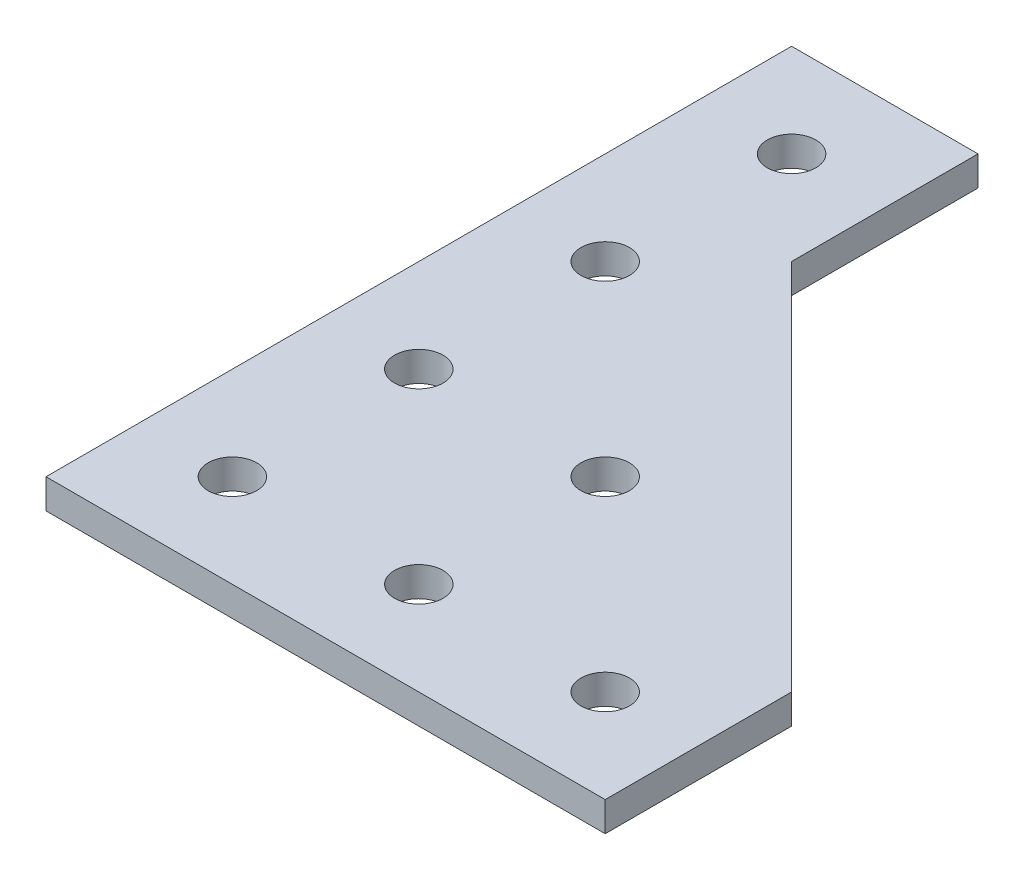
ISO-10303-21;
HEADER;
FILE_DESCRIPTION(('STEP AP214'),'2;1');
FILE_NAME('part.step','',(''),(''),'','','');
FILE_SCHEMA(('AUTOMOTIVE_DESIGN { 1 0 10303 214 1 1 1 1 }'));
ENDSEC;
DATA;
#1=APPLICATION_CONTEXT('core data for automotive mechanical design processes');
#2=APPLICATION_PROTOCOL_DEFINITION('international standard','automotive_design',2000,#1);
#3=PRODUCT_CONTEXT('',#1,'mechanical');
#4=PRODUCT('Part','Part','',(#3));
#5=PRODUCT_RELATED_PRODUCT_CATEGORY('part','',(#4));
#6=PRODUCT_DEFINITION_FORMATION('','',#4);
#7=PRODUCT_DEFINITION_CONTEXT('part definition',#1,'design');
#8=PRODUCT_DEFINITION('design','',#6,#7);
#9=PRODUCT_DEFINITION_SHAPE('','',#8);
#10=(LENGTH_UNIT() NAMED_UNIT(*) SI_UNIT(.MILLI.,.METRE.));
#11=(NAMED_UNIT(*) PLANE_ANGLE_UNIT() SI_UNIT($,.RADIAN.));
#12=(NAMED_UNIT(*) SI_UNIT($,.STERADIAN.) SOLID_ANGLE_UNIT());
#13=UNCERTAINTY_MEASURE_WITH_UNIT(LENGTH_MEASURE(1.E-05),#10,'distance_accuracy_value','');
#14=(GEOMETRIC_REPRESENTATION_CONTEXT(3) GLOBAL_UNCERTAINTY_ASSIGNED_CONTEXT((#13)) GLOBAL_UNIT_ASSIGNED_CONTEXT((#10,
#11,#12)) REPRESENTATION_CONTEXT('',''));
#15=CARTESIAN_POINT('',(0.,0.,0.));
#16=DIRECTION('',(0.,0.,1.));
#17=DIRECTION('',(1.,0.,0.));
#18=AXIS2_PLACEMENT_3D('',#15,#16,#17);
#19=CARTESIAN_POINT('',(0.,3.175,0.));
#20=DIRECTION('',(0.,1.,0.));
#21=DIRECTION('',(0.,0.,1.));
#22=AXIS2_PLACEMENT_3D('',#19,#20,#21);
#23=PLANE('',#22);
#24=CARTESIAN_POINT('',(9.99999999999962,3.175,-50.0000000000001));
#25=DIRECTION('',(0.,1.,0.));
#26=DIRECTION('',(0.,0.,1.));
#27=AXIS2_PLACEMENT_3D('',#24,#25,#26);
#28=CIRCLE('',#27,2.59999999999998);
#29=CARTESIAN_POINT('',(9.99999999999962,3.175,-47.4000000000001));
#30=VERTEX_POINT('',#29);
#31=EDGE_CURVE('E201',#30,#30,#28,.T.);
#32=ORIENTED_EDGE('',*,*,#31,.F.);
#33=EDGE_LOOP('',(#32));
#34=FACE_BOUND('',#33,.T.);
#35=CARTESIAN_POINT('',(9.99999999999976,3.175,-10.0000000000001));
#36=DIRECTION('',(0.,1.,0.));
#37=DIRECTION('',(0.,0.,1.));
#38=AXIS2_PLACEMENT_3D('',#35,#36,#37);
#39=CIRCLE('',#38,2.59999999999998);
#40=CARTESIAN_POINT('',(9.99999999999976,3.175,-7.40000000000011));
#41=VERTEX_POINT('',#40);
#42=EDGE_CURVE('E213',#41,#41,#39,.T.);
#43=ORIENTED_EDGE('',*,*,#42,.F.);
#44=EDGE_LOOP('',(#43));
#45=FACE_BOUND('',#44,.T.);
#46=CARTESIAN_POINT('',(49.9999999999998,3.175,-10.0000000000001));
#47=DIRECTION('',(0.,1.,0.));
#48=DIRECTION('',(0.,0.,1.));
#49=AXIS2_PLACEMENT_3D('',#46,#47,#48);
#50=CIRCLE('',#49,2.59999999999998);
#51=CARTESIAN_POINT('',(49.9999999999998,3.175,-7.40000000000011));
#52=VERTEX_POINT('',#51);
#53=EDGE_CURVE('E225',#52,#52,#50,.T.);
#54=ORIENTED_EDGE('',*,*,#53,.F.);
#55=EDGE_LOOP('',(#54));
#56=FACE_BOUND('',#55,.T.);
#57=DIRECTION('',(0.,0.,-1.));
#58=VECTOR('',#57,1.);
#59=CARTESIAN_POINT('',(59.9999999999995,3.175,-19.9999999999995));
#60=LINE('',#59,#58);
#61=CARTESIAN_POINT('',(60.,3.175,-1.57859836313889E-13));
#62=VERTEX_POINT('',#61);
#63=CARTESIAN_POINT('',(59.9999999999995,3.175,-19.9999999999995));
#64=VERTEX_POINT('',#63);
#65=EDGE_CURVE('E128',#62,#64,#60,.T.);
#66=ORIENTED_EDGE('',*,*,#65,.T.);
#67=DIRECTION('',(-0.707106781186539,0.,-0.707106781186556));
#68=VECTOR('',#67,1.);
#69=CARTESIAN_POINT('',(59.9999999999995,3.175,-19.9999999999995));
#70=LINE('',#69,#68);
#71=CARTESIAN_POINT('',(20.0000000000004,3.175,-59.9999999999996));
#72=VERTEX_POINT('',#71);
#73=EDGE_CURVE('E86',#64,#72,#70,.T.);
#74=ORIENTED_EDGE('',*,*,#73,.T.);
#75=DIRECTION('',(0.,0.,-1.));
#76=VECTOR('',#75,1.);
#77=CARTESIAN_POINT('',(20.0000000000002,3.175,-79.9999999999996));
#78=LINE('',#77,#76);
#79=CARTESIAN_POINT('',(20.0000000000002,3.175,-79.9999999999996));
#80=VERTEX_POINT('',#79);
#81=EDGE_CURVE('E99',#72,#80,#78,.T.);
#82=ORIENTED_EDGE('',*,*,#81,.T.);
#83=DIRECTION('',(-1.,0.,0.));
#84=VECTOR('',#83,1.);
#85=CARTESIAN_POINT('',(-1.91686944095437E-13,3.175,-79.9999999999996));
#86=LINE('',#85,#84);
#87=CARTESIAN_POINT('',(-1.91686944095437E-13,3.175,-79.9999999999996));
#88=VERTEX_POINT('',#87);
#89=EDGE_CURVE('E93',#80,#88,#86,.T.);
#90=ORIENTED_EDGE('',*,*,#89,.T.);
#91=DIRECTION('',(0.,0.,1.));
#92=VECTOR('',#91,1.);
#93=CARTESIAN_POINT('',(0.,3.175,0.));
#94=LINE('',#93,#92);
#95=CARTESIAN_POINT('',(0.,3.175,0.));
#96=VERTEX_POINT('',#95);
#97=EDGE_CURVE('E97',#88,#96,#94,.T.);
#98=ORIENTED_EDGE('',*,*,#97,.T.);
#99=DIRECTION('',(1.,0.,0.));
#100=VECTOR('',#99,1.);
#101=CARTESIAN_POINT('',(0.,3.175,0.));
#102=LINE('',#101,#100);
#103=EDGE_CURVE('E49',#96,#62,#102,.T.);
#104=ORIENTED_EDGE('',*,*,#103,.T.);
#105=EDGE_LOOP('',(#66,#74,#82,#90,#98,#104));
#106=FACE_BOUND('',#105,.T.);
#107=CARTESIAN_POINT('',(29.9999999999998,3.175,-10.0000000000001));
#108=DIRECTION('',(0.,1.,0.));
#109=DIRECTION('',(0.,0.,1.));
#110=AXIS2_PLACEMENT_3D('',#107,#108,#109);
#111=CIRCLE('',#110,2.59999999999998);
#112=CARTESIAN_POINT('',(29.9999999999998,3.175,-7.40000000000011));
#113=VERTEX_POINT('',#112);
#114=EDGE_CURVE('E121',#113,#113,#111,.T.);
#115=ORIENTED_EDGE('',*,*,#114,.F.);
#116=EDGE_LOOP('',(#115));
#117=FACE_BOUND('',#116,.T.);
#118=CARTESIAN_POINT('',(29.9999999999997,3.175,-30.0000000000001));
#119=DIRECTION('',(0.,1.,0.));
#120=DIRECTION('',(0.,0.,1.));
#121=AXIS2_PLACEMENT_3D('',#118,#119,#120);
#122=CIRCLE('',#121,2.59999999999998);
#123=CARTESIAN_POINT('',(29.9999999999997,3.175,-27.4000000000001));
#124=VERTEX_POINT('',#123);
#125=EDGE_CURVE('E219',#124,#124,#122,.T.);
#126=ORIENTED_EDGE('',*,*,#125,.F.);
#127=EDGE_LOOP('',(#126));
#128=FACE_BOUND('',#127,.T.);
#129=CARTESIAN_POINT('',(9.99999999999969,3.175,-30.0000000000001));
#130=DIRECTION('',(0.,1.,0.));
#131=DIRECTION('',(0.,0.,1.));
#132=AXIS2_PLACEMENT_3D('',#129,#130,#131);
#133=CIRCLE('',#132,2.59999999999998);
#134=CARTESIAN_POINT('',(9.99999999999969,3.175,-27.4000000000001));
#135=VERTEX_POINT('',#134);
#136=EDGE_CURVE('E207',#135,#135,#133,.T.);
#137=ORIENTED_EDGE('',*,*,#136,.F.);
#138=EDGE_LOOP('',(#137));
#139=FACE_BOUND('',#138,.T.);
#140=CARTESIAN_POINT('',(9.99999999999955,3.175,-70.0000000000001));
#141=DIRECTION('',(0.,1.,0.));
#142=DIRECTION('',(0.,0.,1.));
#143=AXIS2_PLACEMENT_3D('',#140,#141,#142);
#144=CIRCLE('',#143,2.59999999999998);
#145=CARTESIAN_POINT('',(9.99999999999955,3.175,-67.4000000000001));
#146=VERTEX_POINT('',#145);
#147=EDGE_CURVE('E192',#146,#146,#144,.T.);
#148=ORIENTED_EDGE('',*,*,#147,.F.);
#149=EDGE_LOOP('',(#148));
#150=FACE_BOUND('',#149,.T.);
#151=ADVANCED_FACE('F32',(#34,#45,#56,#106,#117,#128,#139,#150),#23,.T.);
#152=CARTESIAN_POINT('',(0.,0.,0.));
#153=DIRECTION('',(0.,1.,0.));
#154=DIRECTION('',(0.,0.,1.));
#155=AXIS2_PLACEMENT_3D('',#152,#153,#154);
#156=PLANE('',#155);
#157=CARTESIAN_POINT('',(9.99999999999962,0.,-50.0000000000001));
#158=DIRECTION('',(0.,1.,0.));
#159=DIRECTION('',(0.,0.,1.));
#160=AXIS2_PLACEMENT_3D('',#157,#158,#159);
#161=CIRCLE('',#160,2.59999999999998);
#162=CARTESIAN_POINT('',(9.99999999999962,0.,-47.4000000000001));
#163=VERTEX_POINT('',#162);
#164=EDGE_CURVE('E198',#163,#163,#161,.T.);
#165=ORIENTED_EDGE('',*,*,#164,.T.);
#166=EDGE_LOOP('',(#165));
#167=FACE_BOUND('',#166,.T.);
#168=CARTESIAN_POINT('',(9.99999999999976,0.,-10.0000000000001));
#169=DIRECTION('',(0.,1.,0.));
#170=DIRECTION('',(0.,0.,1.));
#171=AXIS2_PLACEMENT_3D('',#168,#169,#170);
#172=CIRCLE('',#171,2.59999999999998);
#173=CARTESIAN_POINT('',(9.99999999999976,0.,-7.40000000000011));
#174=VERTEX_POINT('',#173);
#175=EDGE_CURVE('E210',#174,#174,#172,.T.);
#176=ORIENTED_EDGE('',*,*,#175,.T.);
#177=EDGE_LOOP('',(#176));
#178=FACE_BOUND('',#177,.T.);
#179=CARTESIAN_POINT('',(49.9999999999998,0.,-10.0000000000001));
#180=DIRECTION('',(0.,1.,0.));
#181=DIRECTION('',(0.,0.,1.));
#182=AXIS2_PLACEMENT_3D('',#179,#180,#181);
#183=CIRCLE('',#182,2.59999999999998);
#184=CARTESIAN_POINT('',(49.9999999999998,0.,-7.40000000000011));
#185=VERTEX_POINT('',#184);
#186=EDGE_CURVE('E222',#185,#185,#183,.T.);
#187=ORIENTED_EDGE('',*,*,#186,.T.);
#188=EDGE_LOOP('',(#187));
#189=FACE_BOUND('',#188,.T.);
#190=DIRECTION('',(0.,0.,-1.));
#191=VECTOR('',#190,1.);
#192=CARTESIAN_POINT('',(59.9999999999995,0.,-19.9999999999995));
#193=LINE('',#192,#191);
#194=CARTESIAN_POINT('',(60.,0.,-1.57859836313889E-13));
#195=VERTEX_POINT('',#194);
#196=CARTESIAN_POINT('',(59.9999999999995,0.,-19.9999999999995));
#197=VERTEX_POINT('',#196);
#198=EDGE_CURVE('E117',#195,#197,#193,.T.);
#199=ORIENTED_EDGE('',*,*,#198,.F.);
#200=DIRECTION('',(1.,0.,0.));
#201=VECTOR('',#200,1.);
#202=CARTESIAN_POINT('',(0.,0.,0.));
#203=LINE('',#202,#201);
#204=CARTESIAN_POINT('',(0.,0.,0.));
#205=VERTEX_POINT('',#204);
#206=EDGE_CURVE('E78',#205,#195,#203,.T.);
#207=ORIENTED_EDGE('',*,*,#206,.F.);
#208=DIRECTION('',(0.,0.,1.));
#209=VECTOR('',#208,1.);
#210=CARTESIAN_POINT('',(0.,0.,0.));
#211=LINE('',#210,#209);
#212=CARTESIAN_POINT('',(-1.91686944095437E-13,0.,-79.9999999999996));
#213=VERTEX_POINT('',#212);
#214=EDGE_CURVE('E72',#213,#205,#211,.T.);
#215=ORIENTED_EDGE('',*,*,#214,.F.);
#216=DIRECTION('',(-1.,0.,0.));
#217=VECTOR('',#216,1.);
#218=CARTESIAN_POINT('',(-1.91686944095437E-13,0.,-79.9999999999996));
#219=LINE('',#218,#217);
#220=CARTESIAN_POINT('',(20.0000000000002,0.,-79.9999999999996));
#221=VERTEX_POINT('',#220);
#222=EDGE_CURVE('E107',#221,#213,#219,.T.);
#223=ORIENTED_EDGE('',*,*,#222,.F.);
#224=DIRECTION('',(0.,0.,-1.));
#225=VECTOR('',#224,1.);
#226=CARTESIAN_POINT('',(20.0000000000002,0.,-79.9999999999996));
#227=LINE('',#226,#225);
#228=CARTESIAN_POINT('',(20.0000000000004,0.,-59.9999999999996));
#229=VERTEX_POINT('',#228);
#230=EDGE_CURVE('E123',#229,#221,#227,.T.);
#231=ORIENTED_EDGE('',*,*,#230,.F.);
#232=DIRECTION('',(-0.707106781186539,0.,-0.707106781186556));
#233=VECTOR('',#232,1.);
#234=CARTESIAN_POINT('',(59.9999999999995,0.,-19.9999999999995));
#235=LINE('',#234,#233);
#236=EDGE_CURVE('E120',#197,#229,#235,.T.);
#237=ORIENTED_EDGE('',*,*,#236,.F.);
#238=EDGE_LOOP('',(#199,#207,#215,#223,#231,#237));
#239=FACE_BOUND('',#238,.T.);
#240=CARTESIAN_POINT('',(29.9999999999998,0.,-10.0000000000001));
#241=DIRECTION('',(0.,1.,0.));
#242=DIRECTION('',(0.,0.,1.));
#243=AXIS2_PLACEMENT_3D('',#240,#241,#242);
#244=CIRCLE('',#243,2.59999999999998);
#245=CARTESIAN_POINT('',(29.9999999999998,0.,-7.40000000000011));
#246=VERTEX_POINT('',#245);
#247=EDGE_CURVE('E228',#246,#246,#244,.T.);
#248=ORIENTED_EDGE('',*,*,#247,.T.);
#249=EDGE_LOOP('',(#248));
#250=FACE_BOUND('',#249,.T.);
#251=CARTESIAN_POINT('',(29.9999999999997,0.,-30.0000000000001));
#252=DIRECTION('',(0.,1.,0.));
#253=DIRECTION('',(0.,0.,1.));
#254=AXIS2_PLACEMENT_3D('',#251,#252,#253);
#255=CIRCLE('',#254,2.59999999999998);
#256=CARTESIAN_POINT('',(29.9999999999997,0.,-27.4000000000001));
#257=VERTEX_POINT('',#256);
#258=EDGE_CURVE('E216',#257,#257,#255,.T.);
#259=ORIENTED_EDGE('',*,*,#258,.T.);
#260=EDGE_LOOP('',(#259));
#261=FACE_BOUND('',#260,.T.);
#262=CARTESIAN_POINT('',(9.99999999999969,0.,-30.0000000000001));
#263=DIRECTION('',(0.,1.,0.));
#264=DIRECTION('',(0.,0.,1.));
#265=AXIS2_PLACEMENT_3D('',#262,#263,#264);
#266=CIRCLE('',#265,2.59999999999998);
#267=CARTESIAN_POINT('',(9.99999999999969,0.,-27.4000000000001));
#268=VERTEX_POINT('',#267);
#269=EDGE_CURVE('E204',#268,#268,#266,.T.);
#270=ORIENTED_EDGE('',*,*,#269,.T.);
#271=EDGE_LOOP('',(#270));
#272=FACE_BOUND('',#271,.T.);
#273=CARTESIAN_POINT('',(9.99999999999955,0.,-70.0000000000001));
#274=DIRECTION('',(0.,1.,0.));
#275=DIRECTION('',(0.,0.,1.));
#276=AXIS2_PLACEMENT_3D('',#273,#274,#275);
#277=CIRCLE('',#276,2.59999999999998);
#278=CARTESIAN_POINT('',(9.99999999999955,0.,-67.4000000000001));
#279=VERTEX_POINT('',#278);
#280=EDGE_CURVE('E195',#279,#279,#277,.T.);
#281=ORIENTED_EDGE('',*,*,#280,.T.);
#282=EDGE_LOOP('',(#281));
#283=FACE_BOUND('',#282,.T.);
#284=ADVANCED_FACE('F137',(#167,#178,#189,#239,#250,#261,#272,#283),#156,.F.);
#285=CARTESIAN_POINT('',(59.9999999999995,3.175,-19.9999999999995));
#286=DIRECTION('',(-1.,0.,0.));
#287=DIRECTION('',(0.,0.,1.));
#288=AXIS2_PLACEMENT_3D('',#285,#286,#287);
#289=PLANE('',#288);
#290=ORIENTED_EDGE('',*,*,#198,.T.);
#291=DIRECTION('',(0.,-1.,0.));
#292=VECTOR('',#291,1.);
#293=CARTESIAN_POINT('',(59.9999999999995,3.175,-19.9999999999995));
#294=LINE('',#293,#292);
#295=EDGE_CURVE('E11',#64,#197,#294,.T.);
#296=ORIENTED_EDGE('',*,*,#295,.F.);
#297=ORIENTED_EDGE('',*,*,#65,.F.);
#298=DIRECTION('',(0.,-1.,0.));
#299=VECTOR('',#298,1.);
#300=CARTESIAN_POINT('',(60.,3.175,-1.57859836313889E-13));
#301=LINE('',#300,#299);
#302=EDGE_CURVE('E113',#62,#195,#301,.T.);
#303=ORIENTED_EDGE('',*,*,#302,.T.);
#304=EDGE_LOOP('',(#290,#296,#297,#303));
#305=FACE_BOUND('',#304,.T.);
#306=ADVANCED_FACE('F34',(#305),#289,.F.);
#307=CARTESIAN_POINT('',(59.9999999999995,3.175,-19.9999999999995));
#308=DIRECTION('',(-0.707106781186556,0.,0.707106781186539));
#309=DIRECTION('',(0.707106781186539,0.,0.707106781186556));
#310=AXIS2_PLACEMENT_3D('',#307,#308,#309);
#311=PLANE('',#310);
#312=ORIENTED_EDGE('',*,*,#236,.T.);
#313=DIRECTION('',(0.,-1.,0.));
#314=VECTOR('',#313,1.);
#315=CARTESIAN_POINT('',(20.0000000000004,3.175,-59.9999999999996));
#316=LINE('',#315,#314);
#317=EDGE_CURVE('E41',#72,#229,#316,.T.);
#318=ORIENTED_EDGE('',*,*,#317,.F.);
#319=ORIENTED_EDGE('',*,*,#73,.F.);
#320=ORIENTED_EDGE('',*,*,#295,.T.);
#321=EDGE_LOOP('',(#312,#318,#319,#320));
#322=FACE_BOUND('',#321,.T.);
#323=ADVANCED_FACE('F312',(#322),#311,.F.);
#324=CARTESIAN_POINT('',(20.0000000000002,3.175,-79.9999999999996));
#325=DIRECTION('',(-1.,0.,0.));
#326=DIRECTION('',(0.,0.,1.));
#327=AXIS2_PLACEMENT_3D('',#324,#325,#326);
#328=PLANE('',#327);
#329=ORIENTED_EDGE('',*,*,#230,.T.);
#330=DIRECTION('',(0.,-1.,0.));
#331=VECTOR('',#330,1.);
#332=CARTESIAN_POINT('',(20.0000000000002,3.175,-79.9999999999996));
#333=LINE('',#332,#331);
#334=EDGE_CURVE('E108',#80,#221,#333,.T.);
#335=ORIENTED_EDGE('',*,*,#334,.F.);
#336=ORIENTED_EDGE('',*,*,#81,.F.);
#337=ORIENTED_EDGE('',*,*,#317,.T.);
#338=EDGE_LOOP('',(#329,#335,#336,#337));
#339=FACE_BOUND('',#338,.T.);
#340=ADVANCED_FACE('F134',(#339),#328,.F.);
#341=CARTESIAN_POINT('',(-1.91686944095437E-13,3.175,-79.9999999999996));
#342=DIRECTION('',(0.,0.,1.));
#343=DIRECTION('',(1.,0.,0.));
#344=AXIS2_PLACEMENT_3D('',#341,#342,#343);
#345=PLANE('',#344);
#346=ORIENTED_EDGE('',*,*,#222,.T.);
#347=DIRECTION('',(0.,-1.,0.));
#348=VECTOR('',#347,1.);
#349=CARTESIAN_POINT('',(-1.91686944095437E-13,3.175,-79.9999999999996));
#350=LINE('',#349,#348);
#351=EDGE_CURVE('E104',#88,#213,#350,.T.);
#352=ORIENTED_EDGE('',*,*,#351,.F.);
#353=ORIENTED_EDGE('',*,*,#89,.F.);
#354=ORIENTED_EDGE('',*,*,#334,.T.);
#355=EDGE_LOOP('',(#346,#352,#353,#354));
#356=FACE_BOUND('',#355,.T.);
#357=ADVANCED_FACE('F105',(#356),#345,.F.);
#358=CARTESIAN_POINT('',(0.,3.175,0.));
#359=DIRECTION('',(1.,0.,0.));
#360=DIRECTION('',(0.,0.,-1.));
#361=AXIS2_PLACEMENT_3D('',#358,#359,#360);
#362=PLANE('',#361);
#363=ORIENTED_EDGE('',*,*,#214,.T.);
#364=DIRECTION('',(0.,-1.,0.));
#365=VECTOR('',#364,1.);
#366=CARTESIAN_POINT('',(0.,3.175,0.));
#367=LINE('',#366,#365);
#368=EDGE_CURVE('E109',#96,#205,#367,.T.);
#369=ORIENTED_EDGE('',*,*,#368,.F.);
#370=ORIENTED_EDGE('',*,*,#97,.F.);
#371=ORIENTED_EDGE('',*,*,#351,.T.);
#372=EDGE_LOOP('',(#363,#369,#370,#371));
#373=FACE_BOUND('',#372,.T.);
#374=ADVANCED_FACE('F111',(#373),#362,.F.);
#375=CARTESIAN_POINT('',(0.,3.175,0.));
#376=DIRECTION('',(0.,0.,-1.));
#377=DIRECTION('',(-1.,0.,0.));
#378=AXIS2_PLACEMENT_3D('',#375,#376,#377);
#379=PLANE('',#378);
#380=ORIENTED_EDGE('',*,*,#206,.T.);
#381=ORIENTED_EDGE('',*,*,#302,.F.);
#382=ORIENTED_EDGE('',*,*,#103,.F.);
#383=ORIENTED_EDGE('',*,*,#368,.T.);
#384=EDGE_LOOP('',(#380,#381,#382,#383));
#385=FACE_BOUND('',#384,.T.);
#386=ADVANCED_FACE('F142',(#385),#379,.F.);
#387=CARTESIAN_POINT('',(29.9999999999998,3.175,-10.0000000000001));
#388=DIRECTION('',(0.,-1.,0.));
#389=DIRECTION('',(0.,0.,-1.));
#390=AXIS2_PLACEMENT_3D('',#387,#388,#389);
#391=CYLINDRICAL_SURFACE('',#390,2.59999999999998);
#392=ORIENTED_EDGE('',*,*,#114,.T.);
#393=EDGE_LOOP('',(#392));
#394=FACE_BOUND('',#393,.T.);
#395=ORIENTED_EDGE('',*,*,#247,.F.);
#396=EDGE_LOOP('',(#395));
#397=FACE_BOUND('',#396,.T.);
#398=ADVANCED_FACE('F144',(#394,#397),#391,.F.);
#399=CARTESIAN_POINT('',(49.9999999999998,3.175,-10.0000000000001));
#400=DIRECTION('',(0.,-1.,0.));
#401=DIRECTION('',(0.,0.,-1.));
#402=AXIS2_PLACEMENT_3D('',#399,#400,#401);
#403=CYLINDRICAL_SURFACE('',#402,2.59999999999998);
#404=ORIENTED_EDGE('',*,*,#53,.T.);
#405=EDGE_LOOP('',(#404));
#406=FACE_BOUND('',#405,.T.);
#407=ORIENTED_EDGE('',*,*,#186,.F.);
#408=EDGE_LOOP('',(#407));
#409=FACE_BOUND('',#408,.T.);
#410=ADVANCED_FACE('F150',(#406,#409),#403,.F.);
#411=CARTESIAN_POINT('',(29.9999999999997,3.175,-30.0000000000001));
#412=DIRECTION('',(0.,-1.,0.));
#413=DIRECTION('',(0.,0.,-1.));
#414=AXIS2_PLACEMENT_3D('',#411,#412,#413);
#415=CYLINDRICAL_SURFACE('',#414,2.59999999999998);
#416=ORIENTED_EDGE('',*,*,#125,.T.);
#417=EDGE_LOOP('',(#416));
#418=FACE_BOUND('',#417,.T.);
#419=ORIENTED_EDGE('',*,*,#258,.F.);
#420=EDGE_LOOP('',(#419));
#421=FACE_BOUND('',#420,.T.);
#422=ADVANCED_FACE('F167',(#418,#421),#415,.F.);
#423=CARTESIAN_POINT('',(9.99999999999976,3.175,-10.0000000000001));
#424=DIRECTION('',(0.,-1.,0.));
#425=DIRECTION('',(0.,0.,-1.));
#426=AXIS2_PLACEMENT_3D('',#423,#424,#425);
#427=CYLINDRICAL_SURFACE('',#426,2.59999999999998);
#428=ORIENTED_EDGE('',*,*,#42,.T.);
#429=EDGE_LOOP('',(#428));
#430=FACE_BOUND('',#429,.T.);
#431=ORIENTED_EDGE('',*,*,#175,.F.);
#432=EDGE_LOOP('',(#431));
#433=FACE_BOUND('',#432,.T.);
#434=ADVANCED_FACE('F171',(#430,#433),#427,.F.);
#435=CARTESIAN_POINT('',(9.99999999999969,3.175,-30.0000000000001));
#436=DIRECTION('',(0.,-1.,0.));
#437=DIRECTION('',(0.,0.,-1.));
#438=AXIS2_PLACEMENT_3D('',#435,#436,#437);
#439=CYLINDRICAL_SURFACE('',#438,2.59999999999998);
#440=ORIENTED_EDGE('',*,*,#136,.T.);
#441=EDGE_LOOP('',(#440));
#442=FACE_BOUND('',#441,.T.);
#443=ORIENTED_EDGE('',*,*,#269,.F.);
#444=EDGE_LOOP('',(#443));
#445=FACE_BOUND('',#444,.T.);
#446=ADVANCED_FACE('F175',(#442,#445),#439,.F.);
#447=CARTESIAN_POINT('',(9.99999999999962,3.175,-50.0000000000001));
#448=DIRECTION('',(0.,-1.,0.));
#449=DIRECTION('',(0.,0.,-1.));
#450=AXIS2_PLACEMENT_3D('',#447,#448,#449);
#451=CYLINDRICAL_SURFACE('',#450,2.59999999999998);
#452=ORIENTED_EDGE('',*,*,#31,.T.);
#453=EDGE_LOOP('',(#452));
#454=FACE_BOUND('',#453,.T.);
#455=ORIENTED_EDGE('',*,*,#164,.F.);
#456=EDGE_LOOP('',(#455));
#457=FACE_BOUND('',#456,.T.);
#458=ADVANCED_FACE('F179',(#454,#457),#451,.F.);
#459=CARTESIAN_POINT('',(9.99999999999955,3.175,-70.0000000000001));
#460=DIRECTION('',(0.,-1.,0.));
#461=DIRECTION('',(0.,0.,-1.));
#462=AXIS2_PLACEMENT_3D('',#459,#460,#461);
#463=CYLINDRICAL_SURFACE('',#462,2.59999999999998);
#464=ORIENTED_EDGE('',*,*,#147,.T.);
#465=EDGE_LOOP('',(#464));
#466=FACE_BOUND('',#465,.T.);
#467=ORIENTED_EDGE('',*,*,#280,.F.);
#468=EDGE_LOOP('',(#467));
#469=FACE_BOUND('',#468,.T.);
#470=ADVANCED_FACE('F183',(#466,#469),#463,.F.);
#471=CLOSED_SHELL('',(#151,#284,#306,#323,#340,#357,#374,#386,#398,#410,#422,#434,#446,#458,#470));
#472=MANIFOLD_SOLID_BREP('B2',#471);
#473=ADVANCED_BREP_SHAPE_REPRESENTATION('',(#18,#472),#14);
#474=SHAPE_DEFINITION_REPRESENTATION(#9,#473);
ENDSEC;
END-ISO-10303-21;
